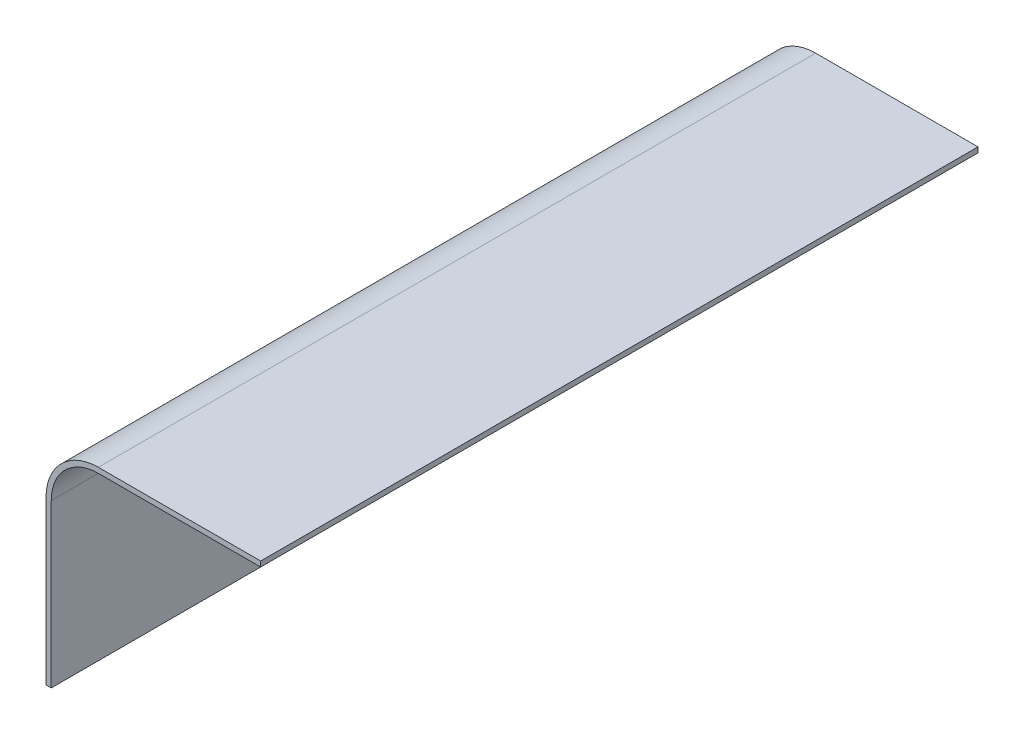
ISO-10303-21;
HEADER;
FILE_DESCRIPTION(('STEP AP214'),'2;1');
FILE_NAME('part.step','',(''),(''),'','','');
FILE_SCHEMA(('AUTOMOTIVE_DESIGN { 1 0 10303 214 1 1 1 1 }'));
ENDSEC;
DATA;
#1=APPLICATION_CONTEXT('core data for automotive mechanical design processes');
#2=APPLICATION_PROTOCOL_DEFINITION('international standard','automotive_design',2000,#1);
#3=PRODUCT_CONTEXT('',#1,'mechanical');
#4=PRODUCT('Part','Part','',(#3));
#5=PRODUCT_RELATED_PRODUCT_CATEGORY('part','',(#4));
#6=PRODUCT_DEFINITION_FORMATION('','',#4);
#7=PRODUCT_DEFINITION_CONTEXT('part definition',#1,'design');
#8=PRODUCT_DEFINITION('design','',#6,#7);
#9=PRODUCT_DEFINITION_SHAPE('','',#8);
#10=(LENGTH_UNIT() NAMED_UNIT(*) SI_UNIT(.MILLI.,.METRE.));
#11=(NAMED_UNIT(*) PLANE_ANGLE_UNIT() SI_UNIT($,.RADIAN.));
#12=(NAMED_UNIT(*) SI_UNIT($,.STERADIAN.) SOLID_ANGLE_UNIT());
#13=UNCERTAINTY_MEASURE_WITH_UNIT(LENGTH_MEASURE(1.E-05),#10,'distance_accuracy_value','');
#14=(GEOMETRIC_REPRESENTATION_CONTEXT(3) GLOBAL_UNCERTAINTY_ASSIGNED_CONTEXT((#13)) GLOBAL_UNIT_ASSIGNED_CONTEXT((#10,
#11,#12)) REPRESENTATION_CONTEXT('',''));
#15=CARTESIAN_POINT('',(0.,0.,0.));
#16=DIRECTION('',(0.,0.,1.));
#17=DIRECTION('',(1.,0.,0.));
#18=AXIS2_PLACEMENT_3D('',#15,#16,#17);
#19=CARTESIAN_POINT('',(-2.,0.,-274.));
#20=DIRECTION('',(0.,-1.,0.));
#21=DIRECTION('',(0.,0.,-1.));
#22=AXIS2_PLACEMENT_3D('',#19,#20,#21);
#23=PLANE('',#22);
#24=DIRECTION('',(1.,0.,0.));
#25=VECTOR('',#24,1.);
#26=CARTESIAN_POINT('',(-2.,0.,0.));
#27=LINE('',#26,#25);
#28=CARTESIAN_POINT('',(-2.,0.,0.));
#29=VERTEX_POINT('',#28);
#30=CARTESIAN_POINT('',(0.,0.,0.));
#31=VERTEX_POINT('',#30);
#32=EDGE_CURVE('E130',#29,#31,#27,.T.);
#33=ORIENTED_EDGE('',*,*,#32,.F.);
#34=DIRECTION('',(0.,0.,1.));
#35=VECTOR('',#34,1.);
#36=CARTESIAN_POINT('',(-2.,0.,-274.));
#37=LINE('',#36,#35);
#38=CARTESIAN_POINT('',(-2.,0.,-274.));
#39=VERTEX_POINT('',#38);
#40=EDGE_CURVE('E11',#39,#29,#37,.T.);
#41=ORIENTED_EDGE('',*,*,#40,.F.);
#42=DIRECTION('',(1.,0.,0.));
#43=VECTOR('',#42,1.);
#44=CARTESIAN_POINT('',(-2.,0.,-274.));
#45=LINE('',#44,#43);
#46=CARTESIAN_POINT('',(0.,0.,-274.));
#47=VERTEX_POINT('',#46);
#48=EDGE_CURVE('E150',#39,#47,#45,.T.);
#49=ORIENTED_EDGE('',*,*,#48,.T.);
#50=DIRECTION('',(0.,0.,1.));
#51=VECTOR('',#50,1.);
#52=CARTESIAN_POINT('',(0.,0.,-274.));
#53=LINE('',#52,#51);
#54=EDGE_CURVE('E36',#47,#31,#53,.T.);
#55=ORIENTED_EDGE('',*,*,#54,.T.);
#56=EDGE_LOOP('',(#33,#41,#49,#55));
#57=FACE_BOUND('',#56,.T.);
#58=ADVANCED_FACE('F33',(#57),#23,.T.);
#59=CARTESIAN_POINT('',(-2.,0.,-274.));
#60=DIRECTION('',(-1.,0.,0.));
#61=DIRECTION('',(0.,0.,1.));
#62=AXIS2_PLACEMENT_3D('',#59,#60,#61);
#63=PLANE('',#62);
#64=DIRECTION('',(0.,-1.,0.));
#65=VECTOR('',#64,1.);
#66=CARTESIAN_POINT('',(-2.,0.,0.));
#67=LINE('',#66,#65);
#68=CARTESIAN_POINT('',(-2.,62.,0.));
#69=VERTEX_POINT('',#68);
#70=EDGE_CURVE('E148',#69,#29,#67,.T.);
#71=ORIENTED_EDGE('',*,*,#70,.F.);
#72=DIRECTION('',(0.,0.,1.));
#73=VECTOR('',#72,1.);
#74=CARTESIAN_POINT('',(-2.,62.,-274.));
#75=LINE('',#74,#73);
#76=CARTESIAN_POINT('',(-2.,62.,-274.));
#77=VERTEX_POINT('',#76);
#78=EDGE_CURVE('E42',#77,#69,#75,.T.);
#79=ORIENTED_EDGE('',*,*,#78,.F.);
#80=DIRECTION('',(0.,-1.,0.));
#81=VECTOR('',#80,1.);
#82=CARTESIAN_POINT('',(-2.,0.,-274.));
#83=LINE('',#82,#81);
#84=EDGE_CURVE('E120',#77,#39,#83,.T.);
#85=ORIENTED_EDGE('',*,*,#84,.T.);
#86=ORIENTED_EDGE('',*,*,#40,.T.);
#87=EDGE_LOOP('',(#71,#79,#85,#86));
#88=FACE_BOUND('',#87,.T.);
#89=ADVANCED_FACE('F162',(#88),#63,.T.);
#90=CARTESIAN_POINT('',(18.,62.,-274.));
#91=DIRECTION('',(0.,0.,1.));
#92=DIRECTION('',(1.,0.,0.));
#93=AXIS2_PLACEMENT_3D('',#90,#91,#92);
#94=CYLINDRICAL_SURFACE('',#93,20.);
#95=CARTESIAN_POINT('',(18.,62.,0.));
#96=DIRECTION('',(0.,0.,1.));
#97=DIRECTION('',(-1.,0.,0.));
#98=AXIS2_PLACEMENT_3D('',#95,#96,#97);
#99=CIRCLE('',#98,20.);
#100=CARTESIAN_POINT('',(18.,82.,0.));
#101=VERTEX_POINT('',#100);
#102=EDGE_CURVE('E107',#101,#69,#99,.T.);
#103=ORIENTED_EDGE('',*,*,#102,.F.);
#104=DIRECTION('',(0.,0.,1.));
#105=VECTOR('',#104,1.);
#106=CARTESIAN_POINT('',(18.,82.,-274.));
#107=LINE('',#106,#105);
#108=CARTESIAN_POINT('',(18.,82.,-274.));
#109=VERTEX_POINT('',#108);
#110=EDGE_CURVE('E102',#109,#101,#107,.T.);
#111=ORIENTED_EDGE('',*,*,#110,.F.);
#112=CARTESIAN_POINT('',(18.,62.,-274.));
#113=DIRECTION('',(0.,0.,1.));
#114=DIRECTION('',(-1.,0.,0.));
#115=AXIS2_PLACEMENT_3D('',#112,#113,#114);
#116=CIRCLE('',#115,20.);
#117=EDGE_CURVE('E105',#109,#77,#116,.T.);
#118=ORIENTED_EDGE('',*,*,#117,.T.);
#119=ORIENTED_EDGE('',*,*,#78,.T.);
#120=EDGE_LOOP('',(#103,#111,#118,#119));
#121=FACE_BOUND('',#120,.T.);
#122=ADVANCED_FACE('F104',(#121),#94,.T.);
#123=CARTESIAN_POINT('',(18.,82.,-274.));
#124=DIRECTION('',(0.,1.,0.));
#125=DIRECTION('',(0.,0.,1.));
#126=AXIS2_PLACEMENT_3D('',#123,#124,#125);
#127=PLANE('',#126);
#128=DIRECTION('',(-1.,0.,0.));
#129=VECTOR('',#128,1.);
#130=CARTESIAN_POINT('',(18.,82.,0.));
#131=LINE('',#130,#129);
#132=CARTESIAN_POINT('',(80.,82.,0.));
#133=VERTEX_POINT('',#132);
#134=EDGE_CURVE('E145',#133,#101,#131,.T.);
#135=ORIENTED_EDGE('',*,*,#134,.F.);
#136=DIRECTION('',(0.,0.,1.));
#137=VECTOR('',#136,1.);
#138=CARTESIAN_POINT('',(80.,82.,-274.));
#139=LINE('',#138,#137);
#140=CARTESIAN_POINT('',(80.,82.,-274.));
#141=VERTEX_POINT('',#140);
#142=EDGE_CURVE('E112',#141,#133,#139,.T.);
#143=ORIENTED_EDGE('',*,*,#142,.F.);
#144=DIRECTION('',(-1.,0.,0.));
#145=VECTOR('',#144,1.);
#146=CARTESIAN_POINT('',(18.,82.,-274.));
#147=LINE('',#146,#145);
#148=EDGE_CURVE('E118',#141,#109,#147,.T.);
#149=ORIENTED_EDGE('',*,*,#148,.T.);
#150=ORIENTED_EDGE('',*,*,#110,.T.);
#151=EDGE_LOOP('',(#135,#143,#149,#150));
#152=FACE_BOUND('',#151,.T.);
#153=ADVANCED_FACE('F122',(#152),#127,.T.);
#154=CARTESIAN_POINT('',(80.,80.,-274.));
#155=DIRECTION('',(1.,0.,0.));
#156=DIRECTION('',(0.,0.,-1.));
#157=AXIS2_PLACEMENT_3D('',#154,#155,#156);
#158=PLANE('',#157);
#159=DIRECTION('',(0.,1.,0.));
#160=VECTOR('',#159,1.);
#161=CARTESIAN_POINT('',(80.,80.,0.));
#162=LINE('',#161,#160);
#163=CARTESIAN_POINT('',(80.,80.,0.));
#164=VERTEX_POINT('',#163);
#165=EDGE_CURVE('E142',#164,#133,#162,.T.);
#166=ORIENTED_EDGE('',*,*,#165,.F.);
#167=DIRECTION('',(0.,0.,1.));
#168=VECTOR('',#167,1.);
#169=CARTESIAN_POINT('',(80.,80.,-274.));
#170=LINE('',#169,#168);
#171=CARTESIAN_POINT('',(80.,80.,-274.));
#172=VERTEX_POINT('',#171);
#173=EDGE_CURVE('E154',#172,#164,#170,.T.);
#174=ORIENTED_EDGE('',*,*,#173,.F.);
#175=DIRECTION('',(0.,1.,0.));
#176=VECTOR('',#175,1.);
#177=CARTESIAN_POINT('',(80.,80.,-274.));
#178=LINE('',#177,#176);
#179=EDGE_CURVE('E123',#172,#141,#178,.T.);
#180=ORIENTED_EDGE('',*,*,#179,.T.);
#181=ORIENTED_EDGE('',*,*,#142,.T.);
#182=EDGE_LOOP('',(#166,#174,#180,#181));
#183=FACE_BOUND('',#182,.T.);
#184=ADVANCED_FACE('F175',(#183),#158,.T.);
#185=CARTESIAN_POINT('',(18.,80.,-274.));
#186=DIRECTION('',(0.,-1.,0.));
#187=DIRECTION('',(0.,0.,-1.));
#188=AXIS2_PLACEMENT_3D('',#185,#186,#187);
#189=PLANE('',#188);
#190=DIRECTION('',(1.,0.,0.));
#191=VECTOR('',#190,1.);
#192=CARTESIAN_POINT('',(18.,80.,0.));
#193=LINE('',#192,#191);
#194=CARTESIAN_POINT('',(18.,80.,0.));
#195=VERTEX_POINT('',#194);
#196=EDGE_CURVE('E139',#195,#164,#193,.T.);
#197=ORIENTED_EDGE('',*,*,#196,.F.);
#198=DIRECTION('',(0.,0.,1.));
#199=VECTOR('',#198,1.);
#200=CARTESIAN_POINT('',(18.,80.,-274.));
#201=LINE('',#200,#199);
#202=CARTESIAN_POINT('',(18.,80.,-274.));
#203=VERTEX_POINT('',#202);
#204=EDGE_CURVE('E156',#203,#195,#201,.T.);
#205=ORIENTED_EDGE('',*,*,#204,.F.);
#206=DIRECTION('',(1.,0.,0.));
#207=VECTOR('',#206,1.);
#208=CARTESIAN_POINT('',(18.,80.,-274.));
#209=LINE('',#208,#207);
#210=EDGE_CURVE('E125',#203,#172,#209,.T.);
#211=ORIENTED_EDGE('',*,*,#210,.T.);
#212=ORIENTED_EDGE('',*,*,#173,.T.);
#213=EDGE_LOOP('',(#197,#205,#211,#212));
#214=FACE_BOUND('',#213,.T.);
#215=ADVANCED_FACE('F178',(#214),#189,.T.);
#216=CARTESIAN_POINT('',(18.,62.,-274.));
#217=DIRECTION('',(0.,0.,1.));
#218=DIRECTION('',(1.,0.,0.));
#219=AXIS2_PLACEMENT_3D('',#216,#217,#218);
#220=CYLINDRICAL_SURFACE('',#219,18.);
#221=CARTESIAN_POINT('',(18.,62.,0.));
#222=DIRECTION('',(0.,0.,-1.));
#223=DIRECTION('',(-1.,0.,0.));
#224=AXIS2_PLACEMENT_3D('',#221,#222,#223);
#225=CIRCLE('',#224,18.);
#226=CARTESIAN_POINT('',(0.,62.,0.));
#227=VERTEX_POINT('',#226);
#228=EDGE_CURVE('E136',#227,#195,#225,.T.);
#229=ORIENTED_EDGE('',*,*,#228,.F.);
#230=DIRECTION('',(0.,0.,1.));
#231=VECTOR('',#230,1.);
#232=CARTESIAN_POINT('',(0.,62.,-274.));
#233=LINE('',#232,#231);
#234=CARTESIAN_POINT('',(0.,62.,-274.));
#235=VERTEX_POINT('',#234);
#236=EDGE_CURVE('E157',#235,#227,#233,.T.);
#237=ORIENTED_EDGE('',*,*,#236,.F.);
#238=CARTESIAN_POINT('',(18.,62.,-274.));
#239=DIRECTION('',(0.,0.,-1.));
#240=DIRECTION('',(-1.,0.,0.));
#241=AXIS2_PLACEMENT_3D('',#238,#239,#240);
#242=CIRCLE('',#241,18.);
#243=EDGE_CURVE('E253',#235,#203,#242,.T.);
#244=ORIENTED_EDGE('',*,*,#243,.T.);
#245=ORIENTED_EDGE('',*,*,#204,.T.);
#246=EDGE_LOOP('',(#229,#237,#244,#245));
#247=FACE_BOUND('',#246,.T.);
#248=ADVANCED_FACE('F182',(#247),#220,.F.);
#249=CARTESIAN_POINT('',(0.,0.,-274.));
#250=DIRECTION('',(1.,0.,0.));
#251=DIRECTION('',(0.,0.,-1.));
#252=AXIS2_PLACEMENT_3D('',#249,#250,#251);
#253=PLANE('',#252);
#254=DIRECTION('',(0.,1.,0.));
#255=VECTOR('',#254,1.);
#256=CARTESIAN_POINT('',(0.,0.,0.));
#257=LINE('',#256,#255);
#258=EDGE_CURVE('E133',#31,#227,#257,.T.);
#259=ORIENTED_EDGE('',*,*,#258,.F.);
#260=ORIENTED_EDGE('',*,*,#54,.F.);
#261=DIRECTION('',(0.,1.,0.));
#262=VECTOR('',#261,1.);
#263=CARTESIAN_POINT('',(0.,0.,-274.));
#264=LINE('',#263,#262);
#265=EDGE_CURVE('E254',#47,#235,#264,.T.);
#266=ORIENTED_EDGE('',*,*,#265,.T.);
#267=ORIENTED_EDGE('',*,*,#236,.T.);
#268=EDGE_LOOP('',(#259,#260,#266,#267));
#269=FACE_BOUND('',#268,.T.);
#270=ADVANCED_FACE('F159',(#269),#253,.T.);
#271=CARTESIAN_POINT('',(18.,62.,-274.));
#272=DIRECTION('',(0.,0.,-1.));
#273=DIRECTION('',(-1.,0.,0.));
#274=AXIS2_PLACEMENT_3D('',#271,#272,#273);
#275=PLANE('',#274);
#276=ORIENTED_EDGE('',*,*,#48,.F.);
#277=ORIENTED_EDGE('',*,*,#84,.F.);
#278=ORIENTED_EDGE('',*,*,#117,.F.);
#279=ORIENTED_EDGE('',*,*,#148,.F.);
#280=ORIENTED_EDGE('',*,*,#179,.F.);
#281=ORIENTED_EDGE('',*,*,#210,.F.);
#282=ORIENTED_EDGE('',*,*,#243,.F.);
#283=ORIENTED_EDGE('',*,*,#265,.F.);
#284=EDGE_LOOP('',(#276,#277,#278,#279,#280,#281,#282,#283));
#285=FACE_BOUND('',#284,.T.);
#286=ADVANCED_FACE('F116',(#285),#275,.T.);
#287=CARTESIAN_POINT('',(18.,62.,0.));
#288=DIRECTION('',(0.,0.,-1.));
#289=DIRECTION('',(-1.,0.,0.));
#290=AXIS2_PLACEMENT_3D('',#287,#288,#289);
#291=PLANE('',#290);
#292=ORIENTED_EDGE('',*,*,#32,.T.);
#293=ORIENTED_EDGE('',*,*,#258,.T.);
#294=ORIENTED_EDGE('',*,*,#228,.T.);
#295=ORIENTED_EDGE('',*,*,#196,.T.);
#296=ORIENTED_EDGE('',*,*,#165,.T.);
#297=ORIENTED_EDGE('',*,*,#134,.T.);
#298=ORIENTED_EDGE('',*,*,#102,.T.);
#299=ORIENTED_EDGE('',*,*,#70,.T.);
#300=EDGE_LOOP('',(#292,#293,#294,#295,#296,#297,#298,#299));
#301=FACE_BOUND('',#300,.T.);
#302=ADVANCED_FACE('F161',(#301),#291,.F.);
#303=CLOSED_SHELL('',(#58,#89,#122,#153,#184,#215,#248,#270,#286,#302));
#304=MANIFOLD_SOLID_BREP('B2',#303);
#305=ADVANCED_BREP_SHAPE_REPRESENTATION('',(#18,#304),#14);
#306=SHAPE_DEFINITION_REPRESENTATION(#9,#305);
ENDSEC;
END-ISO-10303-21;
